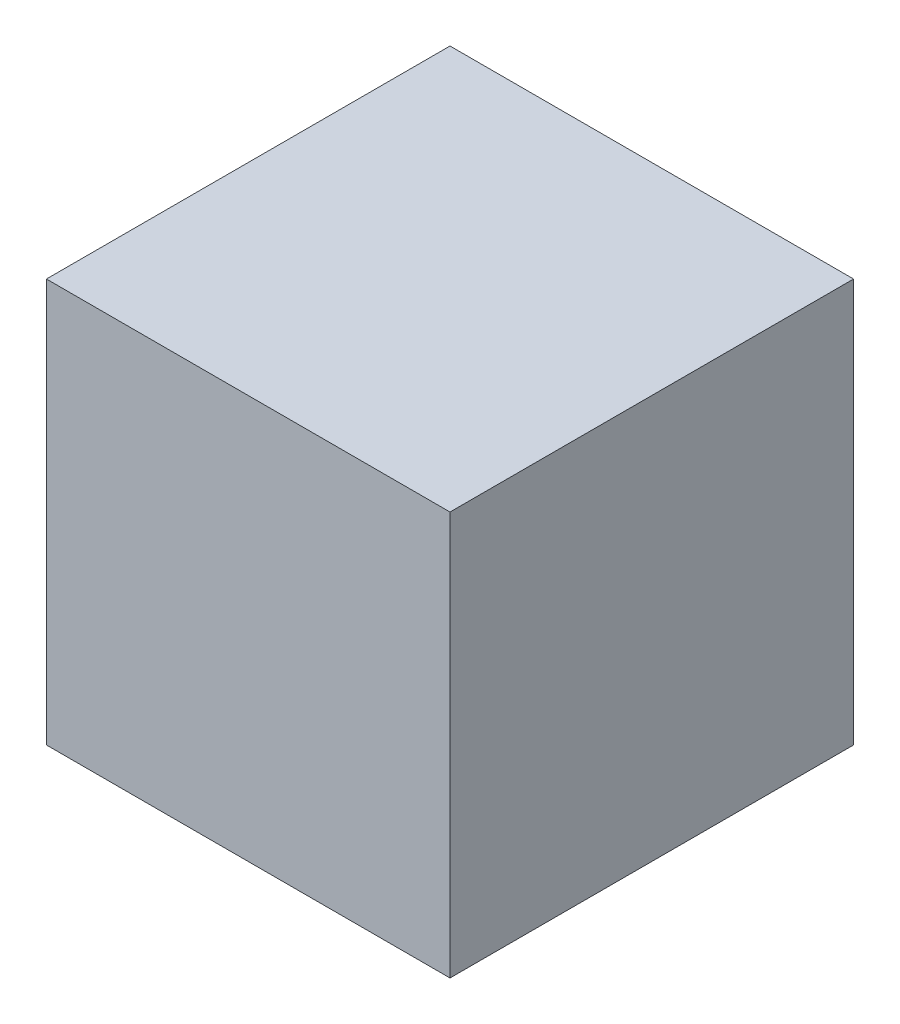
ISO-10303-21;
HEADER;
FILE_DESCRIPTION(('STEP AP214'),'2;1');
FILE_NAME('part.step','',(''),(''),'','','');
FILE_SCHEMA(('AUTOMOTIVE_DESIGN { 1 0 10303 214 1 1 1 1 }'));
ENDSEC;
DATA;
#1=APPLICATION_CONTEXT('core data for automotive mechanical design processes');
#2=APPLICATION_PROTOCOL_DEFINITION('international standard','automotive_design',2000,#1);
#3=PRODUCT_CONTEXT('',#1,'mechanical');
#4=PRODUCT('Part','Part','',(#3));
#5=PRODUCT_RELATED_PRODUCT_CATEGORY('part','',(#4));
#6=PRODUCT_DEFINITION_FORMATION('','',#4);
#7=PRODUCT_DEFINITION_CONTEXT('part definition',#1,'design');
#8=PRODUCT_DEFINITION('design','',#6,#7);
#9=PRODUCT_DEFINITION_SHAPE('','',#8);
#10=(LENGTH_UNIT() NAMED_UNIT(*) SI_UNIT(.MILLI.,.METRE.));
#11=(NAMED_UNIT(*) PLANE_ANGLE_UNIT() SI_UNIT($,.RADIAN.));
#12=(NAMED_UNIT(*) SI_UNIT($,.STERADIAN.) SOLID_ANGLE_UNIT());
#13=UNCERTAINTY_MEASURE_WITH_UNIT(LENGTH_MEASURE(1.E-05),#10,'distance_accuracy_value','');
#14=(GEOMETRIC_REPRESENTATION_CONTEXT(3) GLOBAL_UNCERTAINTY_ASSIGNED_CONTEXT((#13)) GLOBAL_UNIT_ASSIGNED_CONTEXT((#10,
#11,#12)) REPRESENTATION_CONTEXT('',''));
#15=CARTESIAN_POINT('',(0.,0.,0.));
#16=DIRECTION('',(0.,0.,1.));
#17=DIRECTION('',(1.,0.,0.));
#18=AXIS2_PLACEMENT_3D('',#15,#16,#17);
#19=CARTESIAN_POINT('',(-0.500000000000001,-0.500000000000001,0.));
#20=DIRECTION('',(0.,0.,1.));
#21=DIRECTION('',(1.,0.,0.));
#22=AXIS2_PLACEMENT_3D('',#19,#20,#21);
#23=PLANE('',#22);
#24=DIRECTION('',(1.,0.,0.));
#25=VECTOR('',#24,1.);
#26=CARTESIAN_POINT('',(-0.500000000000001,0.500000000000001,0.));
#27=LINE('',#26,#25);
#28=CARTESIAN_POINT('',(-0.500000000000001,0.500000000000001,0.));
#29=VERTEX_POINT('',#28);
#30=CARTESIAN_POINT('',(0.500000000000001,0.500000000000001,0.));
#31=VERTEX_POINT('',#30);
#32=EDGE_CURVE('E80',#29,#31,#27,.T.);
#33=ORIENTED_EDGE('',*,*,#32,.T.);
#34=DIRECTION('',(0.,1.,0.));
#35=VECTOR('',#34,1.);
#36=CARTESIAN_POINT('',(0.500000000000001,0.500000000000001,0.));
#37=LINE('',#36,#35);
#38=CARTESIAN_POINT('',(0.500000000000001,-0.500000000000001,0.));
#39=VERTEX_POINT('',#38);
#40=EDGE_CURVE('E67',#31,#39,#37,.F.);
#41=ORIENTED_EDGE('',*,*,#40,.T.);
#42=DIRECTION('',(1.,0.,0.));
#43=VECTOR('',#42,1.);
#44=CARTESIAN_POINT('',(-0.500000000000001,-0.500000000000001,0.));
#45=LINE('',#44,#43);
#46=CARTESIAN_POINT('',(-0.500000000000001,-0.500000000000001,0.));
#47=VERTEX_POINT('',#46);
#48=EDGE_CURVE('E54',#39,#47,#45,.F.);
#49=ORIENTED_EDGE('',*,*,#48,.T.);
#50=DIRECTION('',(0.,1.,0.));
#51=VECTOR('',#50,1.);
#52=CARTESIAN_POINT('',(-0.500000000000001,0.500000000000001,0.));
#53=LINE('',#52,#51);
#54=EDGE_CURVE('E19',#47,#29,#53,.T.);
#55=ORIENTED_EDGE('',*,*,#54,.T.);
#56=EDGE_LOOP('',(#33,#41,#49,#55));
#57=FACE_BOUND('',#56,.T.);
#58=ADVANCED_FACE('F16',(#57),#23,.F.);
#59=CARTESIAN_POINT('',(-0.500000000000001,0.500000000000001,1.));
#60=DIRECTION('',(1.,0.,0.));
#61=DIRECTION('',(0.,0.,-1.));
#62=AXIS2_PLACEMENT_3D('',#59,#60,#61);
#63=PLANE('',#62);
#64=DIRECTION('',(0.,0.,1.));
#65=VECTOR('',#64,1.);
#66=CARTESIAN_POINT('',(-0.500000000000001,-0.500000000000001,1.));
#67=LINE('',#66,#65);
#68=CARTESIAN_POINT('',(-0.500000000000001,-0.500000000000001,1.));
#69=VERTEX_POINT('',#68);
#70=EDGE_CURVE('E60',#47,#69,#67,.T.);
#71=ORIENTED_EDGE('',*,*,#70,.T.);
#72=DIRECTION('',(0.,1.,0.));
#73=VECTOR('',#72,1.);
#74=CARTESIAN_POINT('',(-0.500000000000001,-0.500000000000001,1.));
#75=LINE('',#74,#73);
#76=CARTESIAN_POINT('',(-0.500000000000001,0.500000000000001,1.));
#77=VERTEX_POINT('',#76);
#78=EDGE_CURVE('E82',#77,#69,#75,.F.);
#79=ORIENTED_EDGE('',*,*,#78,.F.);
#80=DIRECTION('',(0.,0.,-1.));
#81=VECTOR('',#80,1.);
#82=CARTESIAN_POINT('',(-0.500000000000001,0.500000000000001,1.));
#83=LINE('',#82,#81);
#84=EDGE_CURVE('E63',#77,#29,#83,.T.);
#85=ORIENTED_EDGE('',*,*,#84,.T.);
#86=ORIENTED_EDGE('',*,*,#54,.F.);
#87=EDGE_LOOP('',(#71,#79,#85,#86));
#88=FACE_BOUND('',#87,.T.);
#89=ADVANCED_FACE('F59',(#88),#63,.F.);
#90=CARTESIAN_POINT('',(-0.500000000000001,-0.500000000000001,1.));
#91=DIRECTION('',(0.,1.,0.));
#92=DIRECTION('',(0.,0.,1.));
#93=AXIS2_PLACEMENT_3D('',#90,#91,#92);
#94=PLANE('',#93);
#95=DIRECTION('',(0.,0.,1.));
#96=VECTOR('',#95,1.);
#97=CARTESIAN_POINT('',(0.500000000000001,-0.500000000000001,1.));
#98=LINE('',#97,#96);
#99=CARTESIAN_POINT('',(0.500000000000001,-0.500000000000001,1.));
#100=VERTEX_POINT('',#99);
#101=EDGE_CURVE('E69',#39,#100,#98,.T.);
#102=ORIENTED_EDGE('',*,*,#101,.T.);
#103=DIRECTION('',(1.,0.,0.));
#104=VECTOR('',#103,1.);
#105=CARTESIAN_POINT('',(-0.500000000000001,-0.500000000000001,1.));
#106=LINE('',#105,#104);
#107=EDGE_CURVE('E73',#69,#100,#106,.T.);
#108=ORIENTED_EDGE('',*,*,#107,.F.);
#109=ORIENTED_EDGE('',*,*,#70,.F.);
#110=ORIENTED_EDGE('',*,*,#48,.F.);
#111=EDGE_LOOP('',(#102,#108,#109,#110));
#112=FACE_BOUND('',#111,.T.);
#113=ADVANCED_FACE('F71',(#112),#94,.F.);
#114=CARTESIAN_POINT('',(0.500000000000001,0.500000000000001,1.));
#115=DIRECTION('',(-1.,0.,0.));
#116=DIRECTION('',(0.,0.,1.));
#117=AXIS2_PLACEMENT_3D('',#114,#115,#116);
#118=PLANE('',#117);
#119=DIRECTION('',(0.,0.,-1.));
#120=VECTOR('',#119,1.);
#121=CARTESIAN_POINT('',(0.500000000000001,0.500000000000001,1.));
#122=LINE('',#121,#120);
#123=CARTESIAN_POINT('',(0.500000000000001,0.500000000000001,1.));
#124=VERTEX_POINT('',#123);
#125=EDGE_CURVE('E34',#31,#124,#122,.F.);
#126=ORIENTED_EDGE('',*,*,#125,.T.);
#127=DIRECTION('',(0.,1.,0.));
#128=VECTOR('',#127,1.);
#129=CARTESIAN_POINT('',(0.500000000000001,-0.500000000000001,1.));
#130=LINE('',#129,#128);
#131=EDGE_CURVE('E25',#100,#124,#130,.T.);
#132=ORIENTED_EDGE('',*,*,#131,.F.);
#133=ORIENTED_EDGE('',*,*,#101,.F.);
#134=ORIENTED_EDGE('',*,*,#40,.F.);
#135=EDGE_LOOP('',(#126,#132,#133,#134));
#136=FACE_BOUND('',#135,.T.);
#137=ADVANCED_FACE('F88',(#136),#118,.F.);
#138=CARTESIAN_POINT('',(-0.500000000000001,0.500000000000001,1.));
#139=DIRECTION('',(0.,-1.,0.));
#140=DIRECTION('',(0.,0.,-1.));
#141=AXIS2_PLACEMENT_3D('',#138,#139,#140);
#142=PLANE('',#141);
#143=ORIENTED_EDGE('',*,*,#84,.F.);
#144=DIRECTION('',(1.,0.,0.));
#145=VECTOR('',#144,1.);
#146=CARTESIAN_POINT('',(-0.500000000000001,0.500000000000001,1.));
#147=LINE('',#146,#145);
#148=EDGE_CURVE('E10',#124,#77,#147,.F.);
#149=ORIENTED_EDGE('',*,*,#148,.F.);
#150=ORIENTED_EDGE('',*,*,#125,.F.);
#151=ORIENTED_EDGE('',*,*,#32,.F.);
#152=EDGE_LOOP('',(#143,#149,#150,#151));
#153=FACE_BOUND('',#152,.T.);
#154=ADVANCED_FACE('F90',(#153),#142,.F.);
#155=CARTESIAN_POINT('',(-0.500000000000001,-0.500000000000001,1.));
#156=DIRECTION('',(0.,0.,1.));
#157=DIRECTION('',(1.,0.,0.));
#158=AXIS2_PLACEMENT_3D('',#155,#156,#157);
#159=PLANE('',#158);
#160=ORIENTED_EDGE('',*,*,#131,.T.);
#161=ORIENTED_EDGE('',*,*,#148,.T.);
#162=ORIENTED_EDGE('',*,*,#78,.T.);
#163=ORIENTED_EDGE('',*,*,#107,.T.);
#164=EDGE_LOOP('',(#160,#161,#162,#163));
#165=FACE_BOUND('',#164,.T.);
#166=ADVANCED_FACE('F87',(#165),#159,.T.);
#167=CLOSED_SHELL('',(#58,#89,#113,#137,#154,#166));
#168=MANIFOLD_SOLID_BREP('B1',#167);
#169=ADVANCED_BREP_SHAPE_REPRESENTATION('',(#18,#168),#14);
#170=SHAPE_DEFINITION_REPRESENTATION(#9,#169);
ENDSEC;
END-ISO-10303-21;
